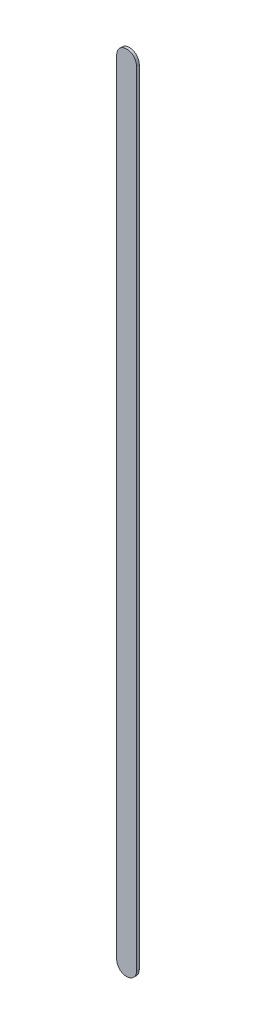
ISO-10303-21;
HEADER;
FILE_DESCRIPTION(('STEP AP214'),'2;1');
FILE_NAME('part.step','',(''),(''),'','','');
FILE_SCHEMA(('AUTOMOTIVE_DESIGN { 1 0 10303 214 1 1 1 1 }'));
ENDSEC;
DATA;
#1=APPLICATION_CONTEXT('core data for automotive mechanical design processes');
#2=APPLICATION_PROTOCOL_DEFINITION('international standard','automotive_design',2000,#1);
#3=PRODUCT_CONTEXT('',#1,'mechanical');
#4=PRODUCT('Part','Part','',(#3));
#5=PRODUCT_RELATED_PRODUCT_CATEGORY('part','',(#4));
#6=PRODUCT_DEFINITION_FORMATION('','',#4);
#7=PRODUCT_DEFINITION_CONTEXT('part definition',#1,'design');
#8=PRODUCT_DEFINITION('design','',#6,#7);
#9=PRODUCT_DEFINITION_SHAPE('','',#8);
#10=(LENGTH_UNIT() NAMED_UNIT(*) SI_UNIT(.MILLI.,.METRE.));
#11=(NAMED_UNIT(*) PLANE_ANGLE_UNIT() SI_UNIT($,.RADIAN.));
#12=(NAMED_UNIT(*) SI_UNIT($,.STERADIAN.) SOLID_ANGLE_UNIT());
#13=UNCERTAINTY_MEASURE_WITH_UNIT(LENGTH_MEASURE(1.E-05),#10,'distance_accuracy_value','');
#14=(GEOMETRIC_REPRESENTATION_CONTEXT(3) GLOBAL_UNCERTAINTY_ASSIGNED_CONTEXT((#13)) GLOBAL_UNIT_ASSIGNED_CONTEXT((#10,
#11,#12)) REPRESENTATION_CONTEXT('',''));
#15=CARTESIAN_POINT('',(0.,0.,0.));
#16=DIRECTION('',(0.,0.,1.));
#17=DIRECTION('',(1.,0.,0.));
#18=AXIS2_PLACEMENT_3D('',#15,#16,#17);
#19=CARTESIAN_POINT('',(99.4939844,85.6869508,0.));
#20=DIRECTION('',(-1.,0.,0.));
#21=DIRECTION('',(0.,1.,0.));
#22=AXIS2_PLACEMENT_3D('',#19,#20,#21);
#23=PLANE('',#22);
#24=DIRECTION('',(0.,1.,0.));
#25=VECTOR('',#24,1.);
#26=CARTESIAN_POINT('',(99.4939844,85.6869508,0.03556));
#27=LINE('',#26,#25);
#28=CARTESIAN_POINT('',(99.4939844,85.6869508,0.03556));
#29=VERTEX_POINT('',#28);
#30=CARTESIAN_POINT('',(99.4939844,95.73696118,0.03556));
#31=VERTEX_POINT('',#30);
#32=EDGE_CURVE('E11',#29,#31,#27,.T.);
#33=ORIENTED_EDGE('',*,*,#32,.F.);
#34=DIRECTION('',(0.,0.,1.));
#35=VECTOR('',#34,1.);
#36=CARTESIAN_POINT('',(99.4939844,85.6869508,0.));
#37=LINE('',#36,#35);
#38=CARTESIAN_POINT('',(99.4939844,85.6869508,0.));
#39=VERTEX_POINT('',#38);
#40=EDGE_CURVE('E24',#39,#29,#37,.T.);
#41=ORIENTED_EDGE('',*,*,#40,.F.);
#42=DIRECTION('',(0.,1.,0.));
#43=VECTOR('',#42,1.);
#44=CARTESIAN_POINT('',(99.4939844,85.6869508,0.));
#45=LINE('',#44,#43);
#46=CARTESIAN_POINT('',(99.4939844,95.73696118,0.));
#47=VERTEX_POINT('',#46);
#48=EDGE_CURVE('E75',#39,#47,#45,.T.);
#49=ORIENTED_EDGE('',*,*,#48,.T.);
#50=DIRECTION('',(0.,0.,1.));
#51=VECTOR('',#50,1.);
#52=CARTESIAN_POINT('',(99.4939844,95.73696118,0.));
#53=LINE('',#52,#51);
#54=EDGE_CURVE('E37',#47,#31,#53,.T.);
#55=ORIENTED_EDGE('',*,*,#54,.T.);
#56=EDGE_LOOP('',(#33,#41,#49,#55));
#57=FACE_BOUND('',#56,.T.);
#58=ADVANCED_FACE('F17',(#57),#23,.F.);
#59=CARTESIAN_POINT('',(99.3669844,95.73696118,0.));
#60=DIRECTION('',(0.,0.,-1.));
#61=DIRECTION('',(1.,0.,0.));
#62=AXIS2_PLACEMENT_3D('',#59,#60,#61);
#63=CYLINDRICAL_SURFACE('',#62,0.126999999999995);
#64=CARTESIAN_POINT('',(99.3669844,95.73696118,0.03556));
#65=DIRECTION('',(0.,0.,1.));
#66=DIRECTION('',(1.,0.,0.));
#67=AXIS2_PLACEMENT_3D('',#64,#65,#66);
#68=CIRCLE('',#67,0.126999999999995);
#69=CARTESIAN_POINT('',(99.2399844,95.73696118,0.03556));
#70=VERTEX_POINT('',#69);
#71=EDGE_CURVE('E83',#31,#70,#68,.T.);
#72=ORIENTED_EDGE('',*,*,#71,.F.);
#73=ORIENTED_EDGE('',*,*,#54,.F.);
#74=CARTESIAN_POINT('',(99.3669844,95.73696118,0.));
#75=DIRECTION('',(0.,0.,1.));
#76=DIRECTION('',(1.,0.,0.));
#77=AXIS2_PLACEMENT_3D('',#74,#75,#76);
#78=CIRCLE('',#77,0.126999999999995);
#79=CARTESIAN_POINT('',(99.2399844,95.73696118,0.));
#80=VERTEX_POINT('',#79);
#81=EDGE_CURVE('E81',#47,#80,#78,.T.);
#82=ORIENTED_EDGE('',*,*,#81,.T.);
#83=DIRECTION('',(0.,0.,1.));
#84=VECTOR('',#83,1.);
#85=CARTESIAN_POINT('',(99.2399844,95.73696118,0.));
#86=LINE('',#85,#84);
#87=EDGE_CURVE('E67',#80,#70,#86,.T.);
#88=ORIENTED_EDGE('',*,*,#87,.T.);
#89=EDGE_LOOP('',(#72,#73,#82,#88));
#90=FACE_BOUND('',#89,.T.);
#91=ADVANCED_FACE('F89',(#90),#63,.T.);
#92=CARTESIAN_POINT('',(99.2399844,95.73696118,0.));
#93=DIRECTION('',(1.,0.,0.));
#94=DIRECTION('',(0.,-1.,0.));
#95=AXIS2_PLACEMENT_3D('',#92,#93,#94);
#96=PLANE('',#95);
#97=DIRECTION('',(0.,-1.,0.));
#98=VECTOR('',#97,1.);
#99=CARTESIAN_POINT('',(99.2399844,95.73696118,0.03556));
#100=LINE('',#99,#98);
#101=CARTESIAN_POINT('',(99.2399844,85.6869508,0.03556));
#102=VERTEX_POINT('',#101);
#103=EDGE_CURVE('E71',#70,#102,#100,.T.);
#104=ORIENTED_EDGE('',*,*,#103,.F.);
#105=ORIENTED_EDGE('',*,*,#87,.F.);
#106=DIRECTION('',(0.,-1.,0.));
#107=VECTOR('',#106,1.);
#108=CARTESIAN_POINT('',(99.2399844,95.73696118,0.));
#109=LINE('',#108,#107);
#110=CARTESIAN_POINT('',(99.2399844,85.6869508,0.));
#111=VERTEX_POINT('',#110);
#112=EDGE_CURVE('E63',#80,#111,#109,.T.);
#113=ORIENTED_EDGE('',*,*,#112,.T.);
#114=DIRECTION('',(0.,0.,1.));
#115=VECTOR('',#114,1.);
#116=CARTESIAN_POINT('',(99.2399844,85.6869508,0.));
#117=LINE('',#116,#115);
#118=EDGE_CURVE('E53',#111,#102,#117,.T.);
#119=ORIENTED_EDGE('',*,*,#118,.T.);
#120=EDGE_LOOP('',(#104,#105,#113,#119));
#121=FACE_BOUND('',#120,.T.);
#122=ADVANCED_FACE('F66',(#121),#96,.F.);
#123=CARTESIAN_POINT('',(99.3669844,85.6869508,0.));
#124=DIRECTION('',(0.,0.,-1.));
#125=DIRECTION('',(-1.,0.,0.));
#126=AXIS2_PLACEMENT_3D('',#123,#124,#125);
#127=CYLINDRICAL_SURFACE('',#126,0.126999999999995);
#128=CARTESIAN_POINT('',(99.3669844,85.6869508,0.03556));
#129=DIRECTION('',(0.,0.,1.));
#130=DIRECTION('',(-1.,0.,0.));
#131=AXIS2_PLACEMENT_3D('',#128,#129,#130);
#132=CIRCLE('',#131,0.126999999999995);
#133=EDGE_CURVE('E59',#102,#29,#132,.T.);
#134=ORIENTED_EDGE('',*,*,#133,.F.);
#135=ORIENTED_EDGE('',*,*,#118,.F.);
#136=CARTESIAN_POINT('',(99.3669844,85.6869508,0.));
#137=DIRECTION('',(0.,0.,1.));
#138=DIRECTION('',(-1.,0.,0.));
#139=AXIS2_PLACEMENT_3D('',#136,#137,#138);
#140=CIRCLE('',#139,0.126999999999995);
#141=EDGE_CURVE('E57',#111,#39,#140,.T.);
#142=ORIENTED_EDGE('',*,*,#141,.T.);
#143=ORIENTED_EDGE('',*,*,#40,.T.);
#144=EDGE_LOOP('',(#134,#135,#142,#143));
#145=FACE_BOUND('',#144,.T.);
#146=ADVANCED_FACE('F55',(#145),#127,.T.);
#147=CARTESIAN_POINT('',(99.4939844,85.6869508,0.));
#148=DIRECTION('',(0.,0.,-1.));
#149=DIRECTION('',(-1.,0.,0.));
#150=AXIS2_PLACEMENT_3D('',#147,#148,#149);
#151=PLANE('',#150);
#152=ORIENTED_EDGE('',*,*,#141,.F.);
#153=ORIENTED_EDGE('',*,*,#112,.F.);
#154=ORIENTED_EDGE('',*,*,#81,.F.);
#155=ORIENTED_EDGE('',*,*,#48,.F.);
#156=EDGE_LOOP('',(#152,#153,#154,#155));
#157=FACE_BOUND('',#156,.T.);
#158=ADVANCED_FACE('F74',(#157),#151,.T.);
#159=CARTESIAN_POINT('',(99.4939844,85.6869508,0.03556));
#160=DIRECTION('',(0.,0.,-1.));
#161=DIRECTION('',(-1.,0.,0.));
#162=AXIS2_PLACEMENT_3D('',#159,#160,#161);
#163=PLANE('',#162);
#164=ORIENTED_EDGE('',*,*,#32,.T.);
#165=ORIENTED_EDGE('',*,*,#71,.T.);
#166=ORIENTED_EDGE('',*,*,#103,.T.);
#167=ORIENTED_EDGE('',*,*,#133,.T.);
#168=EDGE_LOOP('',(#164,#165,#166,#167));
#169=FACE_BOUND('',#168,.T.);
#170=ADVANCED_FACE('F91',(#169),#163,.F.);
#171=CLOSED_SHELL('',(#58,#91,#122,#146,#158,#170));
#172=MANIFOLD_SOLID_BREP('B1',#171);
#173=ADVANCED_BREP_SHAPE_REPRESENTATION('',(#18,#172),#14);
#174=SHAPE_DEFINITION_REPRESENTATION(#9,#173);
ENDSEC;
END-ISO-10303-21;
